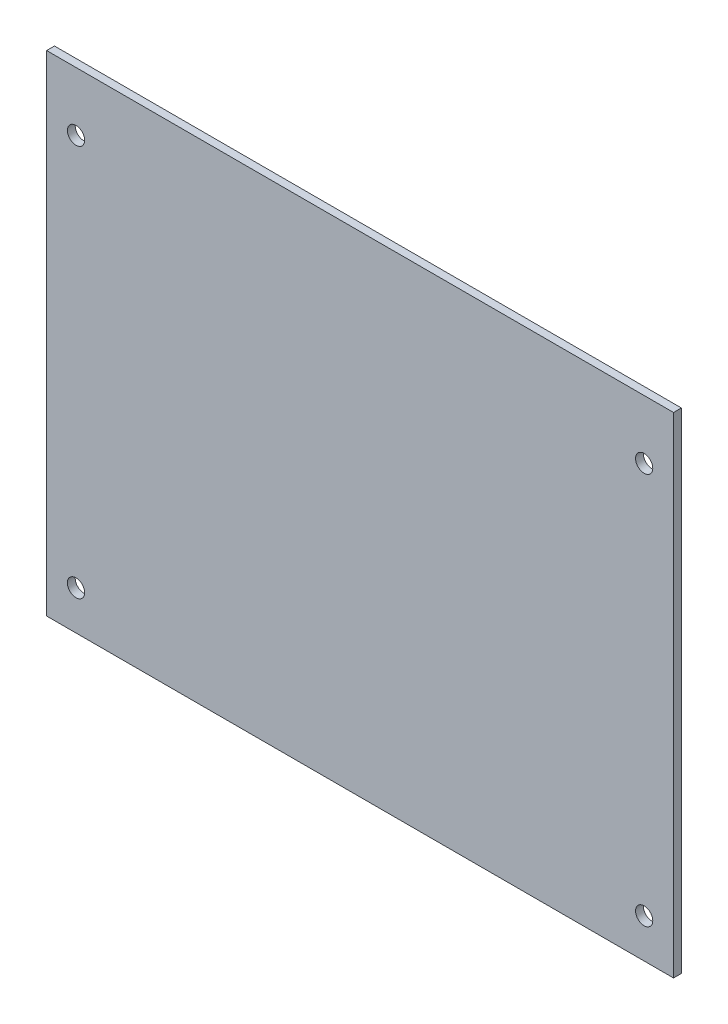
ISO-10303-21;
HEADER;
FILE_DESCRIPTION(('STEP AP214'),'2;1');
FILE_NAME('part.step','',(''),(''),'','','');
FILE_SCHEMA(('AUTOMOTIVE_DESIGN { 1 0 10303 214 1 1 1 1 }'));
ENDSEC;
DATA;
#1=APPLICATION_CONTEXT('core data for automotive mechanical design processes');
#2=APPLICATION_PROTOCOL_DEFINITION('international standard','automotive_design',2000,#1);
#3=PRODUCT_CONTEXT('',#1,'mechanical');
#4=PRODUCT('Part','Part','',(#3));
#5=PRODUCT_RELATED_PRODUCT_CATEGORY('part','',(#4));
#6=PRODUCT_DEFINITION_FORMATION('','',#4);
#7=PRODUCT_DEFINITION_CONTEXT('part definition',#1,'design');
#8=PRODUCT_DEFINITION('design','',#6,#7);
#9=PRODUCT_DEFINITION_SHAPE('','',#8);
#10=(LENGTH_UNIT() NAMED_UNIT(*) SI_UNIT(.MILLI.,.METRE.));
#11=(NAMED_UNIT(*) PLANE_ANGLE_UNIT() SI_UNIT($,.RADIAN.));
#12=(NAMED_UNIT(*) SI_UNIT($,.STERADIAN.) SOLID_ANGLE_UNIT());
#13=UNCERTAINTY_MEASURE_WITH_UNIT(LENGTH_MEASURE(1.E-05),#10,'distance_accuracy_value','');
#14=(GEOMETRIC_REPRESENTATION_CONTEXT(3) GLOBAL_UNCERTAINTY_ASSIGNED_CONTEXT((#13)) GLOBAL_UNIT_ASSIGNED_CONTEXT((#10,
#11,#12)) REPRESENTATION_CONTEXT('',''));
#15=CARTESIAN_POINT('',(0.,0.,0.));
#16=DIRECTION('',(0.,0.,1.));
#17=DIRECTION('',(1.,0.,0.));
#18=AXIS2_PLACEMENT_3D('',#15,#16,#17);
#19=CARTESIAN_POINT('',(80.,62.5,2.));
#20=DIRECTION('',(-1.,0.,0.));
#21=DIRECTION('',(0.,-1.,0.));
#22=AXIS2_PLACEMENT_3D('',#19,#20,#21);
#23=PLANE('',#22);
#24=DIRECTION('',(0.,1.,0.));
#25=VECTOR('',#24,1.);
#26=CARTESIAN_POINT('',(80.,62.5,0.));
#27=LINE('',#26,#25);
#28=CARTESIAN_POINT('',(80.,-62.5,0.));
#29=VERTEX_POINT('',#28);
#30=CARTESIAN_POINT('',(80.,62.5,0.));
#31=VERTEX_POINT('',#30);
#32=EDGE_CURVE('E106',#29,#31,#27,.T.);
#33=ORIENTED_EDGE('',*,*,#32,.T.);
#34=DIRECTION('',(0.,0.,-1.));
#35=VECTOR('',#34,1.);
#36=CARTESIAN_POINT('',(80.,62.5,2.));
#37=LINE('',#36,#35);
#38=CARTESIAN_POINT('',(80.,62.5,2.));
#39=VERTEX_POINT('',#38);
#40=EDGE_CURVE('E11',#39,#31,#37,.T.);
#41=ORIENTED_EDGE('',*,*,#40,.F.);
#42=DIRECTION('',(0.,1.,0.));
#43=VECTOR('',#42,1.);
#44=CARTESIAN_POINT('',(80.,62.5,2.));
#45=LINE('',#44,#43);
#46=CARTESIAN_POINT('',(80.,-62.5,2.));
#47=VERTEX_POINT('',#46);
#48=EDGE_CURVE('E90',#47,#39,#45,.T.);
#49=ORIENTED_EDGE('',*,*,#48,.F.);
#50=DIRECTION('',(0.,0.,-1.));
#51=VECTOR('',#50,1.);
#52=CARTESIAN_POINT('',(80.,-62.5,2.));
#53=LINE('',#52,#51);
#54=EDGE_CURVE('E102',#47,#29,#53,.T.);
#55=ORIENTED_EDGE('',*,*,#54,.T.);
#56=EDGE_LOOP('',(#33,#41,#49,#55));
#57=FACE_BOUND('',#56,.T.);
#58=ADVANCED_FACE('F38',(#57),#23,.F.);
#59=CARTESIAN_POINT('',(-80.,62.5,2.));
#60=DIRECTION('',(0.,-1.,0.));
#61=DIRECTION('',(0.,0.,-1.));
#62=AXIS2_PLACEMENT_3D('',#59,#60,#61);
#63=PLANE('',#62);
#64=DIRECTION('',(-1.,0.,0.));
#65=VECTOR('',#64,1.);
#66=CARTESIAN_POINT('',(-80.,62.5,0.));
#67=LINE('',#66,#65);
#68=CARTESIAN_POINT('',(-80.,62.5,0.));
#69=VERTEX_POINT('',#68);
#70=EDGE_CURVE('E95',#31,#69,#67,.T.);
#71=ORIENTED_EDGE('',*,*,#70,.T.);
#72=DIRECTION('',(0.,0.,-1.));
#73=VECTOR('',#72,1.);
#74=CARTESIAN_POINT('',(-80.,62.5,2.));
#75=LINE('',#74,#73);
#76=CARTESIAN_POINT('',(-80.,62.5,2.));
#77=VERTEX_POINT('',#76);
#78=EDGE_CURVE('E47',#77,#69,#75,.T.);
#79=ORIENTED_EDGE('',*,*,#78,.F.);
#80=DIRECTION('',(-1.,0.,0.));
#81=VECTOR('',#80,1.);
#82=CARTESIAN_POINT('',(-80.,62.5,2.));
#83=LINE('',#82,#81);
#84=EDGE_CURVE('E85',#39,#77,#83,.T.);
#85=ORIENTED_EDGE('',*,*,#84,.F.);
#86=ORIENTED_EDGE('',*,*,#40,.T.);
#87=EDGE_LOOP('',(#71,#79,#85,#86));
#88=FACE_BOUND('',#87,.T.);
#89=ADVANCED_FACE('F94',(#88),#63,.F.);
#90=CARTESIAN_POINT('',(-80.,62.5,2.));
#91=DIRECTION('',(1.,0.,0.));
#92=DIRECTION('',(0.,0.,-1.));
#93=AXIS2_PLACEMENT_3D('',#90,#91,#92);
#94=PLANE('',#93);
#95=DIRECTION('',(0.,-1.,0.));
#96=VECTOR('',#95,1.);
#97=CARTESIAN_POINT('',(-80.,62.5,0.));
#98=LINE('',#97,#96);
#99=CARTESIAN_POINT('',(-80.,-62.5,0.));
#100=VERTEX_POINT('',#99);
#101=EDGE_CURVE('E72',#69,#100,#98,.T.);
#102=ORIENTED_EDGE('',*,*,#101,.T.);
#103=DIRECTION('',(0.,0.,-1.));
#104=VECTOR('',#103,1.);
#105=CARTESIAN_POINT('',(-80.,-62.5,2.));
#106=LINE('',#105,#104);
#107=CARTESIAN_POINT('',(-80.,-62.5,2.));
#108=VERTEX_POINT('',#107);
#109=EDGE_CURVE('E97',#108,#100,#106,.T.);
#110=ORIENTED_EDGE('',*,*,#109,.F.);
#111=DIRECTION('',(0.,-1.,0.));
#112=VECTOR('',#111,1.);
#113=CARTESIAN_POINT('',(-80.,62.5,2.));
#114=LINE('',#113,#112);
#115=EDGE_CURVE('E88',#77,#108,#114,.T.);
#116=ORIENTED_EDGE('',*,*,#115,.F.);
#117=ORIENTED_EDGE('',*,*,#78,.T.);
#118=EDGE_LOOP('',(#102,#110,#116,#117));
#119=FACE_BOUND('',#118,.T.);
#120=ADVANCED_FACE('F98',(#119),#94,.F.);
#121=CARTESIAN_POINT('',(-80.,-62.5,2.));
#122=DIRECTION('',(0.,1.,0.));
#123=DIRECTION('',(0.,0.,1.));
#124=AXIS2_PLACEMENT_3D('',#121,#122,#123);
#125=PLANE('',#124);
#126=DIRECTION('',(1.,0.,0.));
#127=VECTOR('',#126,1.);
#128=CARTESIAN_POINT('',(-80.,-62.5,0.));
#129=LINE('',#128,#127);
#130=EDGE_CURVE('E78',#100,#29,#129,.T.);
#131=ORIENTED_EDGE('',*,*,#130,.T.);
#132=ORIENTED_EDGE('',*,*,#54,.F.);
#133=DIRECTION('',(1.,0.,0.));
#134=VECTOR('',#133,1.);
#135=CARTESIAN_POINT('',(-80.,-62.5,2.));
#136=LINE('',#135,#134);
#137=EDGE_CURVE('E55',#108,#47,#136,.T.);
#138=ORIENTED_EDGE('',*,*,#137,.F.);
#139=ORIENTED_EDGE('',*,*,#109,.T.);
#140=EDGE_LOOP('',(#131,#132,#138,#139));
#141=FACE_BOUND('',#140,.T.);
#142=ADVANCED_FACE('F120',(#141),#125,.F.);
#143=CARTESIAN_POINT('',(0.,0.,2.));
#144=DIRECTION('',(0.,0.,1.));
#145=DIRECTION('',(1.,0.,0.));
#146=AXIS2_PLACEMENT_3D('',#143,#144,#145);
#147=PLANE('',#146);
#148=CARTESIAN_POINT('',(-72.5,47.5,2.));
#149=DIRECTION('',(0.,0.,1.));
#150=DIRECTION('',(1.,0.,0.));
#151=AXIS2_PLACEMENT_3D('',#148,#149,#150);
#152=CIRCLE('',#151,2.20000000000001);
#153=CARTESIAN_POINT('',(-70.3,47.5,2.));
#154=VERTEX_POINT('',#153);
#155=EDGE_CURVE('E139',#154,#154,#152,.T.);
#156=ORIENTED_EDGE('',*,*,#155,.F.);
#157=EDGE_LOOP('',(#156));
#158=FACE_BOUND('',#157,.T.);
#159=CARTESIAN_POINT('',(72.5,47.5,2.));
#160=DIRECTION('',(0.,0.,1.));
#161=DIRECTION('',(1.,0.,0.));
#162=AXIS2_PLACEMENT_3D('',#159,#160,#161);
#163=CIRCLE('',#162,2.20000000000001);
#164=CARTESIAN_POINT('',(74.7,47.5,2.));
#165=VERTEX_POINT('',#164);
#166=EDGE_CURVE('E147',#165,#165,#163,.T.);
#167=ORIENTED_EDGE('',*,*,#166,.F.);
#168=EDGE_LOOP('',(#167));
#169=FACE_BOUND('',#168,.T.);
#170=CARTESIAN_POINT('',(72.5,-52.5,2.));
#171=DIRECTION('',(0.,0.,1.));
#172=DIRECTION('',(1.,0.,0.));
#173=AXIS2_PLACEMENT_3D('',#170,#171,#172);
#174=CIRCLE('',#173,2.2);
#175=CARTESIAN_POINT('',(74.7,-52.5,2.));
#176=VERTEX_POINT('',#175);
#177=EDGE_CURVE('E131',#176,#176,#174,.T.);
#178=ORIENTED_EDGE('',*,*,#177,.F.);
#179=EDGE_LOOP('',(#178));
#180=FACE_BOUND('',#179,.T.);
#181=CARTESIAN_POINT('',(-72.5,-52.5,2.));
#182=DIRECTION('',(0.,0.,1.));
#183=DIRECTION('',(1.,0.,0.));
#184=AXIS2_PLACEMENT_3D('',#181,#182,#183);
#185=CIRCLE('',#184,2.2);
#186=CARTESIAN_POINT('',(-70.3,-52.5,2.));
#187=VERTEX_POINT('',#186);
#188=EDGE_CURVE('E127',#187,#187,#185,.T.);
#189=ORIENTED_EDGE('',*,*,#188,.F.);
#190=EDGE_LOOP('',(#189));
#191=FACE_BOUND('',#190,.T.);
#192=ORIENTED_EDGE('',*,*,#48,.T.);
#193=ORIENTED_EDGE('',*,*,#84,.T.);
#194=ORIENTED_EDGE('',*,*,#115,.T.);
#195=ORIENTED_EDGE('',*,*,#137,.T.);
#196=EDGE_LOOP('',(#192,#193,#194,#195));
#197=FACE_BOUND('',#196,.T.);
#198=ADVANCED_FACE('F86',(#158,#169,#180,#191,#197),#147,.T.);
#199=CARTESIAN_POINT('',(0.,0.,0.));
#200=DIRECTION('',(0.,0.,1.));
#201=DIRECTION('',(1.,0.,0.));
#202=AXIS2_PLACEMENT_3D('',#199,#200,#201);
#203=PLANE('',#202);
#204=CARTESIAN_POINT('',(-72.5,47.5,0.));
#205=DIRECTION('',(0.,0.,1.));
#206=DIRECTION('',(1.,0.,0.));
#207=AXIS2_PLACEMENT_3D('',#204,#205,#206);
#208=CIRCLE('',#207,2.20000000000001);
#209=CARTESIAN_POINT('',(-70.3,47.5,0.));
#210=VERTEX_POINT('',#209);
#211=EDGE_CURVE('E135',#210,#210,#208,.T.);
#212=ORIENTED_EDGE('',*,*,#211,.T.);
#213=EDGE_LOOP('',(#212));
#214=FACE_BOUND('',#213,.T.);
#215=CARTESIAN_POINT('',(72.5,47.5,0.));
#216=DIRECTION('',(0.,0.,1.));
#217=DIRECTION('',(1.,0.,0.));
#218=AXIS2_PLACEMENT_3D('',#215,#216,#217);
#219=CIRCLE('',#218,2.20000000000001);
#220=CARTESIAN_POINT('',(74.7,47.5,0.));
#221=VERTEX_POINT('',#220);
#222=EDGE_CURVE('E143',#221,#221,#219,.T.);
#223=ORIENTED_EDGE('',*,*,#222,.T.);
#224=EDGE_LOOP('',(#223));
#225=FACE_BOUND('',#224,.T.);
#226=CARTESIAN_POINT('',(72.5,-52.5,0.));
#227=DIRECTION('',(0.,0.,1.));
#228=DIRECTION('',(1.,0.,0.));
#229=AXIS2_PLACEMENT_3D('',#226,#227,#228);
#230=CIRCLE('',#229,2.2);
#231=CARTESIAN_POINT('',(74.7,-52.5,0.));
#232=VERTEX_POINT('',#231);
#233=EDGE_CURVE('E151',#232,#232,#230,.T.);
#234=ORIENTED_EDGE('',*,*,#233,.T.);
#235=EDGE_LOOP('',(#234));
#236=FACE_BOUND('',#235,.T.);
#237=CARTESIAN_POINT('',(-72.5,-52.5,0.));
#238=DIRECTION('',(0.,0.,1.));
#239=DIRECTION('',(1.,0.,0.));
#240=AXIS2_PLACEMENT_3D('',#237,#238,#239);
#241=CIRCLE('',#240,2.2);
#242=CARTESIAN_POINT('',(-70.3,-52.5,0.));
#243=VERTEX_POINT('',#242);
#244=EDGE_CURVE('E110',#243,#243,#241,.T.);
#245=ORIENTED_EDGE('',*,*,#244,.T.);
#246=EDGE_LOOP('',(#245));
#247=FACE_BOUND('',#246,.T.);
#248=ORIENTED_EDGE('',*,*,#32,.F.);
#249=ORIENTED_EDGE('',*,*,#130,.F.);
#250=ORIENTED_EDGE('',*,*,#101,.F.);
#251=ORIENTED_EDGE('',*,*,#70,.F.);
#252=EDGE_LOOP('',(#248,#249,#250,#251));
#253=FACE_BOUND('',#252,.T.);
#254=ADVANCED_FACE('F123',(#214,#225,#236,#247,#253),#203,.F.);
#255=CARTESIAN_POINT('',(-72.5,-52.5,0.));
#256=DIRECTION('',(0.,0.,1.));
#257=DIRECTION('',(1.,0.,0.));
#258=AXIS2_PLACEMENT_3D('',#255,#256,#257);
#259=CYLINDRICAL_SURFACE('',#258,2.2);
#260=ORIENTED_EDGE('',*,*,#244,.F.);
#261=EDGE_LOOP('',(#260));
#262=FACE_BOUND('',#261,.T.);
#263=ORIENTED_EDGE('',*,*,#188,.T.);
#264=EDGE_LOOP('',(#263));
#265=FACE_BOUND('',#264,.T.);
#266=ADVANCED_FACE('F167',(#262,#265),#259,.F.);
#267=CARTESIAN_POINT('',(72.5,-52.5,0.));
#268=DIRECTION('',(0.,0.,1.));
#269=DIRECTION('',(1.,0.,0.));
#270=AXIS2_PLACEMENT_3D('',#267,#268,#269);
#271=CYLINDRICAL_SURFACE('',#270,2.2);
#272=ORIENTED_EDGE('',*,*,#233,.F.);
#273=EDGE_LOOP('',(#272));
#274=FACE_BOUND('',#273,.T.);
#275=ORIENTED_EDGE('',*,*,#177,.T.);
#276=EDGE_LOOP('',(#275));
#277=FACE_BOUND('',#276,.T.);
#278=ADVANCED_FACE('F159',(#274,#277),#271,.F.);
#279=CARTESIAN_POINT('',(72.5,47.5,0.));
#280=DIRECTION('',(0.,0.,1.));
#281=DIRECTION('',(1.,0.,0.));
#282=AXIS2_PLACEMENT_3D('',#279,#280,#281);
#283=CYLINDRICAL_SURFACE('',#282,2.20000000000001);
#284=ORIENTED_EDGE('',*,*,#222,.F.);
#285=EDGE_LOOP('',(#284));
#286=FACE_BOUND('',#285,.T.);
#287=ORIENTED_EDGE('',*,*,#166,.T.);
#288=EDGE_LOOP('',(#287));
#289=FACE_BOUND('',#288,.T.);
#290=ADVANCED_FACE('F175',(#286,#289),#283,.F.);
#291=CARTESIAN_POINT('',(-72.5,47.5,0.));
#292=DIRECTION('',(0.,0.,1.));
#293=DIRECTION('',(1.,0.,0.));
#294=AXIS2_PLACEMENT_3D('',#291,#292,#293);
#295=CYLINDRICAL_SURFACE('',#294,2.20000000000001);
#296=ORIENTED_EDGE('',*,*,#211,.F.);
#297=EDGE_LOOP('',(#296));
#298=FACE_BOUND('',#297,.T.);
#299=ORIENTED_EDGE('',*,*,#155,.T.);
#300=EDGE_LOOP('',(#299));
#301=FACE_BOUND('',#300,.T.);
#302=ADVANCED_FACE('F225',(#298,#301),#295,.F.);
#303=CLOSED_SHELL('',(#58,#89,#120,#142,#198,#254,#266,#278,#290,#302));
#304=MANIFOLD_SOLID_BREP('B2',#303);
#305=ADVANCED_BREP_SHAPE_REPRESENTATION('',(#18,#304),#14);
#306=SHAPE_DEFINITION_REPRESENTATION(#9,#305);
ENDSEC;
END-ISO-10303-21;
